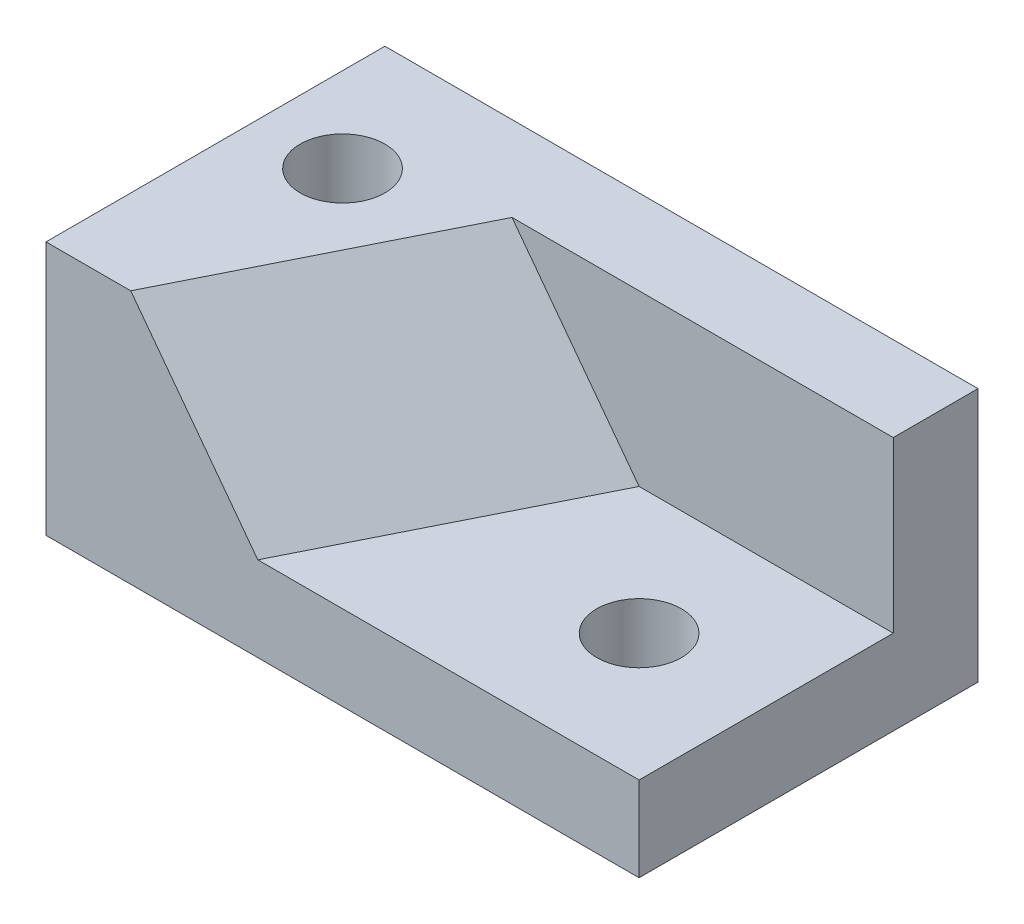
ISO-10303-21;
HEADER;
FILE_DESCRIPTION(('STEP AP214'),'2;1');
FILE_NAME('part.step','',(''),(''),'','','');
FILE_SCHEMA(('AUTOMOTIVE_DESIGN { 1 0 10303 214 1 1 1 1 }'));
ENDSEC;
DATA;
#1=APPLICATION_CONTEXT('core data for automotive mechanical design processes');
#2=APPLICATION_PROTOCOL_DEFINITION('international standard','automotive_design',2000,#1);
#3=PRODUCT_CONTEXT('',#1,'mechanical');
#4=PRODUCT('Part','Part','',(#3));
#5=PRODUCT_RELATED_PRODUCT_CATEGORY('part','',(#4));
#6=PRODUCT_DEFINITION_FORMATION('','',#4);
#7=PRODUCT_DEFINITION_CONTEXT('part definition',#1,'design');
#8=PRODUCT_DEFINITION('design','',#6,#7);
#9=PRODUCT_DEFINITION_SHAPE('','',#8);
#10=(LENGTH_UNIT() NAMED_UNIT(*) SI_UNIT(.MILLI.,.METRE.));
#11=(NAMED_UNIT(*) PLANE_ANGLE_UNIT() SI_UNIT($,.RADIAN.));
#12=(NAMED_UNIT(*) SI_UNIT($,.STERADIAN.) SOLID_ANGLE_UNIT());
#13=UNCERTAINTY_MEASURE_WITH_UNIT(LENGTH_MEASURE(1.E-05),#10,'distance_accuracy_value','');
#14=(GEOMETRIC_REPRESENTATION_CONTEXT(3) GLOBAL_UNCERTAINTY_ASSIGNED_CONTEXT((#13)) GLOBAL_UNIT_ASSIGNED_CONTEXT((#10,
#11,#12)) REPRESENTATION_CONTEXT('',''));
#15=CARTESIAN_POINT('',(0.,0.,0.));
#16=DIRECTION('',(0.,0.,1.));
#17=DIRECTION('',(1.,0.,0.));
#18=AXIS2_PLACEMENT_3D('',#15,#16,#17);
#19=CARTESIAN_POINT('',(0.,30.,0.));
#20=DIRECTION('',(0.,0.,-1.));
#21=DIRECTION('',(-1.,0.,0.));
#22=AXIS2_PLACEMENT_3D('',#19,#20,#21);
#23=PLANE('',#22);
#24=DIRECTION('',(1.,0.,0.));
#25=VECTOR('',#24,1.);
#26=CARTESIAN_POINT('',(70.,10.,0.));
#27=LINE('',#26,#25);
#28=CARTESIAN_POINT('',(25.,9.99999999999999,0.));
#29=VERTEX_POINT('',#28);
#30=CARTESIAN_POINT('',(70.,10.,0.));
#31=VERTEX_POINT('',#30);
#32=EDGE_CURVE('E108',#29,#31,#27,.T.);
#33=ORIENTED_EDGE('',*,*,#32,.F.);
#34=DIRECTION('',(0.6,-0.8,0.));
#35=VECTOR('',#34,1.);
#36=CARTESIAN_POINT('',(9.99999999999999,30.,0.));
#37=LINE('',#36,#35);
#38=CARTESIAN_POINT('',(9.99999999999999,30.,0.));
#39=VERTEX_POINT('',#38);
#40=EDGE_CURVE('E111',#39,#29,#37,.T.);
#41=ORIENTED_EDGE('',*,*,#40,.F.);
#42=DIRECTION('',(1.,0.,0.));
#43=VECTOR('',#42,1.);
#44=CARTESIAN_POINT('',(0.,30.,0.));
#45=LINE('',#44,#43);
#46=CARTESIAN_POINT('',(0.,30.,0.));
#47=VERTEX_POINT('',#46);
#48=EDGE_CURVE('E90',#47,#39,#45,.T.);
#49=ORIENTED_EDGE('',*,*,#48,.F.);
#50=DIRECTION('',(0.,-1.,0.));
#51=VECTOR('',#50,1.);
#52=CARTESIAN_POINT('',(0.,30.,0.));
#53=LINE('',#52,#51);
#54=CARTESIAN_POINT('',(0.,0.,0.));
#55=VERTEX_POINT('',#54);
#56=EDGE_CURVE('E11',#47,#55,#53,.T.);
#57=ORIENTED_EDGE('',*,*,#56,.T.);
#58=DIRECTION('',(1.,0.,0.));
#59=VECTOR('',#58,1.);
#60=CARTESIAN_POINT('',(0.,0.,0.));
#61=LINE('',#60,#59);
#62=CARTESIAN_POINT('',(70.,0.,0.));
#63=VERTEX_POINT('',#62);
#64=EDGE_CURVE('E161',#55,#63,#61,.T.);
#65=ORIENTED_EDGE('',*,*,#64,.T.);
#66=DIRECTION('',(0.,-1.,0.));
#67=VECTOR('',#66,1.);
#68=CARTESIAN_POINT('',(70.,30.,0.));
#69=LINE('',#68,#67);
#70=EDGE_CURVE('E48',#31,#63,#69,.T.);
#71=ORIENTED_EDGE('',*,*,#70,.F.);
#72=EDGE_LOOP('',(#33,#41,#49,#57,#65,#71));
#73=FACE_BOUND('',#72,.T.);
#74=ADVANCED_FACE('F39',(#73),#23,.F.);
#75=CARTESIAN_POINT('',(0.,30.,0.));
#76=DIRECTION('',(0.,-1.,0.));
#77=DIRECTION('',(0.,0.,-1.));
#78=AXIS2_PLACEMENT_3D('',#75,#76,#77);
#79=PLANE('',#78);
#80=CARTESIAN_POINT('',(10.,30.,-25.));
#81=DIRECTION('',(0.,1.,0.));
#82=DIRECTION('',(0.,0.,1.));
#83=AXIS2_PLACEMENT_3D('',#80,#81,#82);
#84=CIRCLE('',#83,5.);
#85=CARTESIAN_POINT('',(10.,30.,-20.));
#86=VERTEX_POINT('',#85);
#87=EDGE_CURVE('E199',#86,#86,#84,.T.);
#88=ORIENTED_EDGE('',*,*,#87,.F.);
#89=EDGE_LOOP('',(#88));
#90=FACE_BOUND('',#89,.T.);
#91=DIRECTION('',(-0.447213595499958,0.,0.894427190999916));
#92=VECTOR('',#91,1.);
#93=CARTESIAN_POINT('',(25.,30.,-30.));
#94=LINE('',#93,#92);
#95=CARTESIAN_POINT('',(25.,30.,-30.));
#96=VERTEX_POINT('',#95);
#97=EDGE_CURVE('E128',#96,#39,#94,.T.);
#98=ORIENTED_EDGE('',*,*,#97,.F.);
#99=DIRECTION('',(-1.,0.,0.));
#100=VECTOR('',#99,1.);
#101=CARTESIAN_POINT('',(70.,30.,-30.));
#102=LINE('',#101,#100);
#103=CARTESIAN_POINT('',(70.,30.,-30.));
#104=VERTEX_POINT('',#103);
#105=EDGE_CURVE('E138',#104,#96,#102,.T.);
#106=ORIENTED_EDGE('',*,*,#105,.F.);
#107=DIRECTION('',(0.,0.,-1.));
#108=VECTOR('',#107,1.);
#109=CARTESIAN_POINT('',(70.,30.,0.));
#110=LINE('',#109,#108);
#111=CARTESIAN_POINT('',(70.,30.,-40.));
#112=VERTEX_POINT('',#111);
#113=EDGE_CURVE('E152',#104,#112,#110,.T.);
#114=ORIENTED_EDGE('',*,*,#113,.T.);
#115=DIRECTION('',(-1.,0.,0.));
#116=VECTOR('',#115,1.);
#117=CARTESIAN_POINT('',(0.,30.,-40.));
#118=LINE('',#117,#116);
#119=CARTESIAN_POINT('',(0.,30.,-40.));
#120=VERTEX_POINT('',#119);
#121=EDGE_CURVE('E64',#112,#120,#118,.T.);
#122=ORIENTED_EDGE('',*,*,#121,.T.);
#123=DIRECTION('',(0.,0.,1.));
#124=VECTOR('',#123,1.);
#125=CARTESIAN_POINT('',(0.,30.,0.));
#126=LINE('',#125,#124);
#127=EDGE_CURVE('E147',#120,#47,#126,.T.);
#128=ORIENTED_EDGE('',*,*,#127,.T.);
#129=ORIENTED_EDGE('',*,*,#48,.T.);
#130=EDGE_LOOP('',(#98,#106,#114,#122,#128,#129));
#131=FACE_BOUND('',#130,.T.);
#132=ADVANCED_FACE('F186',(#90,#131),#79,.F.);
#133=CARTESIAN_POINT('',(0.,30.,0.));
#134=DIRECTION('',(1.,0.,0.));
#135=DIRECTION('',(0.,0.,-1.));
#136=AXIS2_PLACEMENT_3D('',#133,#134,#135);
#137=PLANE('',#136);
#138=DIRECTION('',(0.,0.,1.));
#139=VECTOR('',#138,1.);
#140=CARTESIAN_POINT('',(0.,0.,0.));
#141=LINE('',#140,#139);
#142=CARTESIAN_POINT('',(0.,0.,-40.));
#143=VERTEX_POINT('',#142);
#144=EDGE_CURVE('E146',#143,#55,#141,.T.);
#145=ORIENTED_EDGE('',*,*,#144,.T.);
#146=ORIENTED_EDGE('',*,*,#56,.F.);
#147=ORIENTED_EDGE('',*,*,#127,.F.);
#148=DIRECTION('',(0.,-1.,0.));
#149=VECTOR('',#148,1.);
#150=CARTESIAN_POINT('',(0.,30.,-40.));
#151=LINE('',#150,#149);
#152=EDGE_CURVE('E157',#120,#143,#151,.T.);
#153=ORIENTED_EDGE('',*,*,#152,.T.);
#154=EDGE_LOOP('',(#145,#146,#147,#153));
#155=FACE_BOUND('',#154,.T.);
#156=ADVANCED_FACE('F41',(#155),#137,.F.);
#157=CARTESIAN_POINT('',(70.,30.,0.));
#158=DIRECTION('',(-1.,0.,0.));
#159=DIRECTION('',(0.,0.,1.));
#160=AXIS2_PLACEMENT_3D('',#157,#158,#159);
#161=PLANE('',#160);
#162=DIRECTION('',(0.,1.,0.));
#163=VECTOR('',#162,1.);
#164=CARTESIAN_POINT('',(70.,30.,-30.));
#165=LINE('',#164,#163);
#166=CARTESIAN_POINT('',(70.,10.,-30.));
#167=VERTEX_POINT('',#166);
#168=EDGE_CURVE('E55',#167,#104,#165,.T.);
#169=ORIENTED_EDGE('',*,*,#168,.F.);
#170=DIRECTION('',(0.,0.,1.));
#171=VECTOR('',#170,1.);
#172=CARTESIAN_POINT('',(70.,10.,-30.));
#173=LINE('',#172,#171);
#174=EDGE_CURVE('E142',#167,#31,#173,.T.);
#175=ORIENTED_EDGE('',*,*,#174,.T.);
#176=ORIENTED_EDGE('',*,*,#70,.T.);
#177=DIRECTION('',(0.,0.,-1.));
#178=VECTOR('',#177,1.);
#179=CARTESIAN_POINT('',(70.,0.,0.));
#180=LINE('',#179,#178);
#181=CARTESIAN_POINT('',(70.,0.,-40.));
#182=VERTEX_POINT('',#181);
#183=EDGE_CURVE('E164',#63,#182,#180,.T.);
#184=ORIENTED_EDGE('',*,*,#183,.T.);
#185=DIRECTION('',(0.,-1.,0.));
#186=VECTOR('',#185,1.);
#187=CARTESIAN_POINT('',(70.,30.,-40.));
#188=LINE('',#187,#186);
#189=EDGE_CURVE('E171',#112,#182,#188,.T.);
#190=ORIENTED_EDGE('',*,*,#189,.F.);
#191=ORIENTED_EDGE('',*,*,#113,.F.);
#192=EDGE_LOOP('',(#169,#175,#176,#184,#190,#191));
#193=FACE_BOUND('',#192,.T.);
#194=ADVANCED_FACE('F175',(#193),#161,.F.);
#195=CARTESIAN_POINT('',(0.,30.,-40.));
#196=DIRECTION('',(0.,0.,1.));
#197=DIRECTION('',(1.,0.,0.));
#198=AXIS2_PLACEMENT_3D('',#195,#196,#197);
#199=PLANE('',#198);
#200=DIRECTION('',(-1.,0.,0.));
#201=VECTOR('',#200,1.);
#202=CARTESIAN_POINT('',(0.,0.,-40.));
#203=LINE('',#202,#201);
#204=EDGE_CURVE('E84',#182,#143,#203,.T.);
#205=ORIENTED_EDGE('',*,*,#204,.T.);
#206=ORIENTED_EDGE('',*,*,#152,.F.);
#207=ORIENTED_EDGE('',*,*,#121,.F.);
#208=ORIENTED_EDGE('',*,*,#189,.T.);
#209=EDGE_LOOP('',(#205,#206,#207,#208));
#210=FACE_BOUND('',#209,.T.);
#211=ADVANCED_FACE('F184',(#210),#199,.F.);
#212=CARTESIAN_POINT('',(0.,0.,0.));
#213=DIRECTION('',(0.,-1.,0.));
#214=DIRECTION('',(0.,0.,-1.));
#215=AXIS2_PLACEMENT_3D('',#212,#213,#214);
#216=PLANE('',#215);
#217=CARTESIAN_POINT('',(10.,0.,-25.));
#218=DIRECTION('',(0.,1.,0.));
#219=DIRECTION('',(0.,0.,1.));
#220=AXIS2_PLACEMENT_3D('',#217,#218,#219);
#221=CIRCLE('',#220,5.);
#222=CARTESIAN_POINT('',(10.,0.,-20.));
#223=VERTEX_POINT('',#222);
#224=EDGE_CURVE('E197',#223,#223,#221,.T.);
#225=ORIENTED_EDGE('',*,*,#224,.T.);
#226=EDGE_LOOP('',(#225));
#227=FACE_BOUND('',#226,.T.);
#228=CARTESIAN_POINT('',(55.,0.,-15.));
#229=DIRECTION('',(0.,1.,0.));
#230=DIRECTION('',(-1.,0.,0.));
#231=AXIS2_PLACEMENT_3D('',#228,#229,#230);
#232=CIRCLE('',#231,5.);
#233=CARTESIAN_POINT('',(50.,0.,-15.));
#234=VERTEX_POINT('',#233);
#235=EDGE_CURVE('E189',#234,#234,#232,.T.);
#236=ORIENTED_EDGE('',*,*,#235,.T.);
#237=EDGE_LOOP('',(#236));
#238=FACE_BOUND('',#237,.T.);
#239=ORIENTED_EDGE('',*,*,#144,.F.);
#240=ORIENTED_EDGE('',*,*,#204,.F.);
#241=ORIENTED_EDGE('',*,*,#183,.F.);
#242=ORIENTED_EDGE('',*,*,#64,.F.);
#243=EDGE_LOOP('',(#239,#240,#241,#242));
#244=FACE_BOUND('',#243,.T.);
#245=ADVANCED_FACE('F181',(#227,#238,#244),#216,.T.);
#246=CARTESIAN_POINT('',(70.,10.,-30.));
#247=DIRECTION('',(0.,-1.,0.));
#248=DIRECTION('',(1.,0.,0.));
#249=AXIS2_PLACEMENT_3D('',#246,#247,#248);
#250=PLANE('',#249);
#251=CARTESIAN_POINT('',(55.,10.,-15.));
#252=DIRECTION('',(0.,1.,0.));
#253=DIRECTION('',(-1.,0.,0.));
#254=AXIS2_PLACEMENT_3D('',#251,#252,#253);
#255=CIRCLE('',#254,5.);
#256=CARTESIAN_POINT('',(50.,10.,-15.));
#257=VERTEX_POINT('',#256);
#258=EDGE_CURVE('E192',#257,#257,#255,.T.);
#259=ORIENTED_EDGE('',*,*,#258,.F.);
#260=EDGE_LOOP('',(#259));
#261=FACE_BOUND('',#260,.T.);
#262=ORIENTED_EDGE('',*,*,#32,.T.);
#263=ORIENTED_EDGE('',*,*,#174,.F.);
#264=DIRECTION('',(1.,0.,0.));
#265=VECTOR('',#264,1.);
#266=CARTESIAN_POINT('',(70.,10.,-30.));
#267=LINE('',#266,#265);
#268=CARTESIAN_POINT('',(40.,9.99999999999999,-30.));
#269=VERTEX_POINT('',#268);
#270=EDGE_CURVE('E121',#269,#167,#267,.T.);
#271=ORIENTED_EDGE('',*,*,#270,.F.);
#272=DIRECTION('',(0.447213595499958,0.,-0.894427190999916));
#273=VECTOR('',#272,1.);
#274=CARTESIAN_POINT('',(25.,10.,0.));
#275=LINE('',#274,#273);
#276=EDGE_CURVE('E116',#29,#269,#275,.T.);
#277=ORIENTED_EDGE('',*,*,#276,.F.);
#278=EDGE_LOOP('',(#262,#263,#271,#277));
#279=FACE_BOUND('',#278,.T.);
#280=ADVANCED_FACE('F120',(#261,#279),#250,.F.);
#281=CARTESIAN_POINT('',(0.,0.,-30.));
#282=DIRECTION('',(0.,0.,-1.));
#283=DIRECTION('',(-1.,0.,0.));
#284=AXIS2_PLACEMENT_3D('',#281,#282,#283);
#285=PLANE('',#284);
#286=DIRECTION('',(-0.6,0.8,0.));
#287=VECTOR('',#286,1.);
#288=CARTESIAN_POINT('',(40.,9.99999999999999,-30.));
#289=LINE('',#288,#287);
#290=EDGE_CURVE('E132',#269,#96,#289,.T.);
#291=ORIENTED_EDGE('',*,*,#290,.F.);
#292=ORIENTED_EDGE('',*,*,#270,.T.);
#293=ORIENTED_EDGE('',*,*,#168,.T.);
#294=ORIENTED_EDGE('',*,*,#105,.T.);
#295=EDGE_LOOP('',(#291,#292,#293,#294));
#296=FACE_BOUND('',#295,.T.);
#297=ADVANCED_FACE('F187',(#296),#285,.F.);
#298=CARTESIAN_POINT('',(17.9310344827586,13.448275862069,8.96551724137931));
#299=DIRECTION('',(0.742781352708207,0.557086014531156,0.371390676354104));
#300=DIRECTION('',(-0.6,0.8,0.));
#301=AXIS2_PLACEMENT_3D('',#298,#299,#300);
#302=PLANE('',#301);
#303=ORIENTED_EDGE('',*,*,#290,.T.);
#304=ORIENTED_EDGE('',*,*,#97,.T.);
#305=ORIENTED_EDGE('',*,*,#40,.T.);
#306=ORIENTED_EDGE('',*,*,#276,.T.);
#307=EDGE_LOOP('',(#303,#304,#305,#306));
#308=FACE_BOUND('',#307,.T.);
#309=ADVANCED_FACE('F126',(#308),#302,.T.);
#310=CARTESIAN_POINT('',(55.,0.,-15.));
#311=DIRECTION('',(0.,1.,0.));
#312=DIRECTION('',(-1.,0.,0.));
#313=AXIS2_PLACEMENT_3D('',#310,#311,#312);
#314=CYLINDRICAL_SURFACE('',#313,5.);
#315=ORIENTED_EDGE('',*,*,#235,.F.);
#316=EDGE_LOOP('',(#315));
#317=FACE_BOUND('',#316,.T.);
#318=ORIENTED_EDGE('',*,*,#258,.T.);
#319=EDGE_LOOP('',(#318));
#320=FACE_BOUND('',#319,.T.);
#321=ADVANCED_FACE('F212',(#317,#320),#314,.F.);
#322=CARTESIAN_POINT('',(10.,0.,-25.));
#323=DIRECTION('',(0.,1.,0.));
#324=DIRECTION('',(0.,0.,1.));
#325=AXIS2_PLACEMENT_3D('',#322,#323,#324);
#326=CYLINDRICAL_SURFACE('',#325,5.);
#327=ORIENTED_EDGE('',*,*,#224,.F.);
#328=EDGE_LOOP('',(#327));
#329=FACE_BOUND('',#328,.T.);
#330=ORIENTED_EDGE('',*,*,#87,.T.);
#331=EDGE_LOOP('',(#330));
#332=FACE_BOUND('',#331,.T.);
#333=ADVANCED_FACE('F209',(#329,#332),#326,.F.);
#334=CLOSED_SHELL('',(#74,#132,#156,#194,#211,#245,#280,#297,#309,#321,#333));
#335=MANIFOLD_SOLID_BREP('B2',#334);
#336=ADVANCED_BREP_SHAPE_REPRESENTATION('',(#18,#335),#14);
#337=SHAPE_DEFINITION_REPRESENTATION(#9,#336);
ENDSEC;
END-ISO-10303-21;
